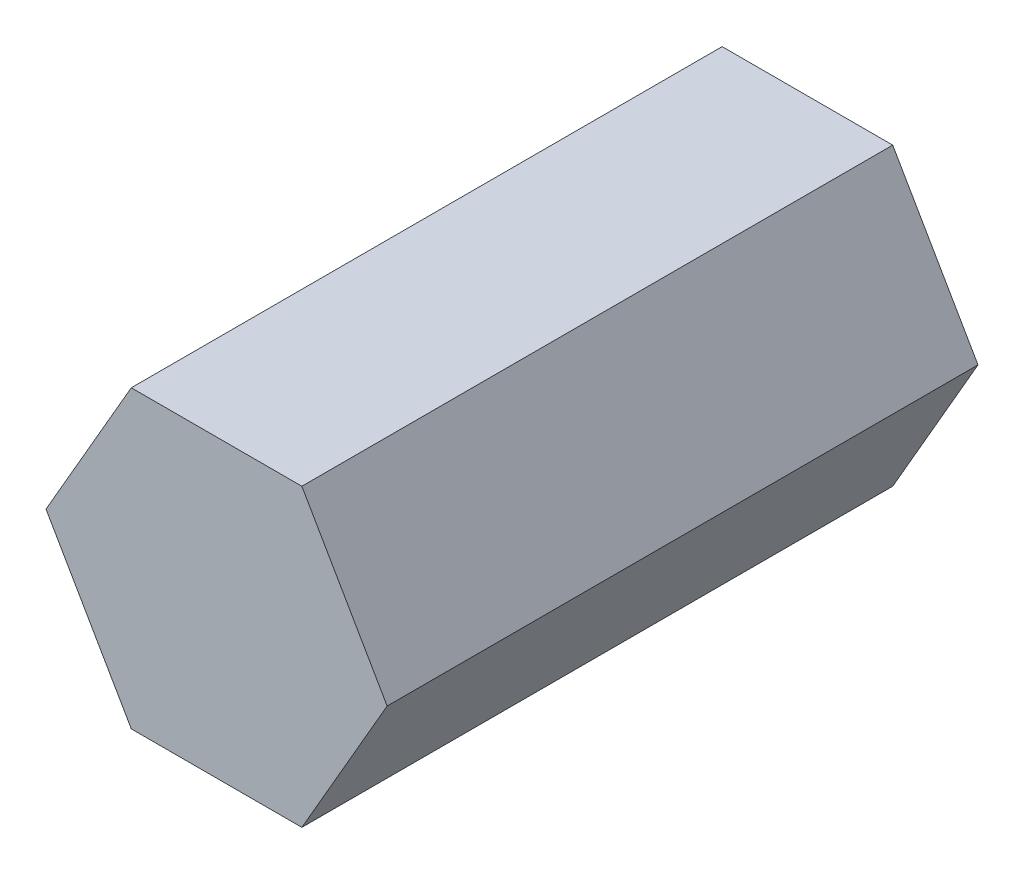
ISO-10303-21;
HEADER;
FILE_DESCRIPTION(('STEP AP214'),'2;1');
FILE_NAME('part.step','',(''),(''),'','','');
FILE_SCHEMA(('AUTOMOTIVE_DESIGN { 1 0 10303 214 1 1 1 1 }'));
ENDSEC;
DATA;
#1=APPLICATION_CONTEXT('core data for automotive mechanical design processes');
#2=APPLICATION_PROTOCOL_DEFINITION('international standard','automotive_design',2000,#1);
#3=PRODUCT_CONTEXT('',#1,'mechanical');
#4=PRODUCT('Part','Part','',(#3));
#5=PRODUCT_RELATED_PRODUCT_CATEGORY('part','',(#4));
#6=PRODUCT_DEFINITION_FORMATION('','',#4);
#7=PRODUCT_DEFINITION_CONTEXT('part definition',#1,'design');
#8=PRODUCT_DEFINITION('design','',#6,#7);
#9=PRODUCT_DEFINITION_SHAPE('','',#8);
#10=(LENGTH_UNIT() NAMED_UNIT(*) SI_UNIT(.MILLI.,.METRE.));
#11=(NAMED_UNIT(*) PLANE_ANGLE_UNIT() SI_UNIT($,.RADIAN.));
#12=(NAMED_UNIT(*) SI_UNIT($,.STERADIAN.) SOLID_ANGLE_UNIT());
#13=UNCERTAINTY_MEASURE_WITH_UNIT(LENGTH_MEASURE(1.E-05),#10,'distance_accuracy_value','');
#14=(GEOMETRIC_REPRESENTATION_CONTEXT(3) GLOBAL_UNCERTAINTY_ASSIGNED_CONTEXT((#13)) GLOBAL_UNIT_ASSIGNED_CONTEXT((#10,
#11,#12)) REPRESENTATION_CONTEXT('',''));
#15=CARTESIAN_POINT('',(0.,0.,0.));
#16=DIRECTION('',(0.,0.,1.));
#17=DIRECTION('',(1.,0.,0.));
#18=AXIS2_PLACEMENT_3D('',#15,#16,#17);
#19=CARTESIAN_POINT('',(3.66617420935412,-6.35,12.7));
#20=DIRECTION('',(-0.866025403784439,0.5,0.));
#21=DIRECTION('',(-0.5,-0.866025403784439,0.));
#22=AXIS2_PLACEMENT_3D('',#19,#20,#21);
#23=PLANE('',#22);
#24=DIRECTION('',(0.5,0.866025403784439,0.));
#25=VECTOR('',#24,1.);
#26=CARTESIAN_POINT('',(3.66617420935412,-6.35,-12.7));
#27=LINE('',#26,#25);
#28=CARTESIAN_POINT('',(3.66617420935412,-6.35,-12.7));
#29=VERTEX_POINT('',#28);
#30=CARTESIAN_POINT('',(7.33234841870825,0.,-12.7));
#31=VERTEX_POINT('',#30);
#32=EDGE_CURVE('E123',#29,#31,#27,.T.);
#33=ORIENTED_EDGE('',*,*,#32,.T.);
#34=DIRECTION('',(0.,0.,-1.));
#35=VECTOR('',#34,1.);
#36=CARTESIAN_POINT('',(7.33234841870825,0.,12.7));
#37=LINE('',#36,#35);
#38=CARTESIAN_POINT('',(7.33234841870825,0.,12.7));
#39=VERTEX_POINT('',#38);
#40=EDGE_CURVE('E11',#39,#31,#37,.T.);
#41=ORIENTED_EDGE('',*,*,#40,.F.);
#42=DIRECTION('',(0.5,0.866025403784439,0.));
#43=VECTOR('',#42,1.);
#44=CARTESIAN_POINT('',(3.66617420935412,-6.35,12.7));
#45=LINE('',#44,#43);
#46=CARTESIAN_POINT('',(3.66617420935412,-6.35,12.7));
#47=VERTEX_POINT('',#46);
#48=EDGE_CURVE('E133',#47,#39,#45,.T.);
#49=ORIENTED_EDGE('',*,*,#48,.F.);
#50=DIRECTION('',(0.,0.,-1.));
#51=VECTOR('',#50,1.);
#52=CARTESIAN_POINT('',(3.66617420935412,-6.35,12.7));
#53=LINE('',#52,#51);
#54=EDGE_CURVE('E119',#47,#29,#53,.T.);
#55=ORIENTED_EDGE('',*,*,#54,.T.);
#56=EDGE_LOOP('',(#33,#41,#49,#55));
#57=FACE_BOUND('',#56,.T.);
#58=ADVANCED_FACE('F39',(#57),#23,.F.);
#59=CARTESIAN_POINT('',(7.33234841870825,0.,12.7));
#60=DIRECTION('',(-0.866025403784439,-0.5,0.));
#61=DIRECTION('',(0.5,-0.866025403784439,0.));
#62=AXIS2_PLACEMENT_3D('',#59,#60,#61);
#63=PLANE('',#62);
#64=DIRECTION('',(-0.5,0.866025403784439,0.));
#65=VECTOR('',#64,1.);
#66=CARTESIAN_POINT('',(7.33234841870825,0.,-12.7));
#67=LINE('',#66,#65);
#68=CARTESIAN_POINT('',(3.66617420935412,6.35,-12.7));
#69=VERTEX_POINT('',#68);
#70=EDGE_CURVE('E126',#31,#69,#67,.T.);
#71=ORIENTED_EDGE('',*,*,#70,.T.);
#72=DIRECTION('',(0.,0.,-1.));
#73=VECTOR('',#72,1.);
#74=CARTESIAN_POINT('',(3.66617420935412,6.35,12.7));
#75=LINE('',#74,#73);
#76=CARTESIAN_POINT('',(3.66617420935412,6.35,12.7));
#77=VERTEX_POINT('',#76);
#78=EDGE_CURVE('E47',#77,#69,#75,.T.);
#79=ORIENTED_EDGE('',*,*,#78,.F.);
#80=DIRECTION('',(-0.5,0.866025403784439,0.));
#81=VECTOR('',#80,1.);
#82=CARTESIAN_POINT('',(7.33234841870825,0.,12.7));
#83=LINE('',#82,#81);
#84=EDGE_CURVE('E92',#39,#77,#83,.T.);
#85=ORIENTED_EDGE('',*,*,#84,.F.);
#86=ORIENTED_EDGE('',*,*,#40,.T.);
#87=EDGE_LOOP('',(#71,#79,#85,#86));
#88=FACE_BOUND('',#87,.T.);
#89=ADVANCED_FACE('F157',(#88),#63,.F.);
#90=CARTESIAN_POINT('',(3.66617420935412,6.35,12.7));
#91=DIRECTION('',(0.,-1.,0.));
#92=DIRECTION('',(1.,0.,0.));
#93=AXIS2_PLACEMENT_3D('',#90,#91,#92);
#94=PLANE('',#93);
#95=DIRECTION('',(-1.,0.,0.));
#96=VECTOR('',#95,1.);
#97=CARTESIAN_POINT('',(3.66617420935412,6.35,-12.7));
#98=LINE('',#97,#96);
#99=CARTESIAN_POINT('',(-3.66617420935412,6.35,-12.7));
#100=VERTEX_POINT('',#99);
#101=EDGE_CURVE('E128',#69,#100,#98,.T.);
#102=ORIENTED_EDGE('',*,*,#101,.T.);
#103=DIRECTION('',(0.,0.,-1.));
#104=VECTOR('',#103,1.);
#105=CARTESIAN_POINT('',(-3.66617420935412,6.35,12.7));
#106=LINE('',#105,#104);
#107=CARTESIAN_POINT('',(-3.66617420935412,6.35,12.7));
#108=VERTEX_POINT('',#107);
#109=EDGE_CURVE('E114',#108,#100,#106,.T.);
#110=ORIENTED_EDGE('',*,*,#109,.F.);
#111=DIRECTION('',(-1.,0.,0.));
#112=VECTOR('',#111,1.);
#113=CARTESIAN_POINT('',(3.66617420935412,6.35,12.7));
#114=LINE('',#113,#112);
#115=EDGE_CURVE('E105',#77,#108,#114,.T.);
#116=ORIENTED_EDGE('',*,*,#115,.F.);
#117=ORIENTED_EDGE('',*,*,#78,.T.);
#118=EDGE_LOOP('',(#102,#110,#116,#117));
#119=FACE_BOUND('',#118,.T.);
#120=ADVANCED_FACE('F139',(#119),#94,.F.);
#121=CARTESIAN_POINT('',(-3.66617420935412,6.35,12.7));
#122=DIRECTION('',(0.866025403784439,-0.5,0.));
#123=DIRECTION('',(0.5,0.866025403784439,0.));
#124=AXIS2_PLACEMENT_3D('',#121,#122,#123);
#125=PLANE('',#124);
#126=DIRECTION('',(-0.5,-0.866025403784439,0.));
#127=VECTOR('',#126,1.);
#128=CARTESIAN_POINT('',(-3.66617420935412,6.35,-12.7));
#129=LINE('',#128,#127);
#130=CARTESIAN_POINT('',(-7.33234841870825,0.,-12.7));
#131=VERTEX_POINT('',#130);
#132=EDGE_CURVE('E113',#100,#131,#129,.T.);
#133=ORIENTED_EDGE('',*,*,#132,.T.);
#134=DIRECTION('',(0.,0.,-1.));
#135=VECTOR('',#134,1.);
#136=CARTESIAN_POINT('',(-7.33234841870825,0.,12.7));
#137=LINE('',#136,#135);
#138=CARTESIAN_POINT('',(-7.33234841870825,0.,12.7));
#139=VERTEX_POINT('',#138);
#140=EDGE_CURVE('E110',#139,#131,#137,.T.);
#141=ORIENTED_EDGE('',*,*,#140,.F.);
#142=DIRECTION('',(-0.5,-0.866025403784439,0.));
#143=VECTOR('',#142,1.);
#144=CARTESIAN_POINT('',(-3.66617420935412,6.35,12.7));
#145=LINE('',#144,#143);
#146=EDGE_CURVE('E99',#108,#139,#145,.T.);
#147=ORIENTED_EDGE('',*,*,#146,.F.);
#148=ORIENTED_EDGE('',*,*,#109,.T.);
#149=EDGE_LOOP('',(#133,#141,#147,#148));
#150=FACE_BOUND('',#149,.T.);
#151=ADVANCED_FACE('F111',(#150),#125,.F.);
#152=CARTESIAN_POINT('',(-7.33234841870825,0.,12.7));
#153=DIRECTION('',(0.866025403784439,0.5,0.));
#154=DIRECTION('',(-0.5,0.866025403784439,0.));
#155=AXIS2_PLACEMENT_3D('',#152,#153,#154);
#156=PLANE('',#155);
#157=DIRECTION('',(0.5,-0.866025403784439,0.));
#158=VECTOR('',#157,1.);
#159=CARTESIAN_POINT('',(-7.33234841870825,0.,-12.7));
#160=LINE('',#159,#158);
#161=CARTESIAN_POINT('',(-3.66617420935413,-6.35,-12.7));
#162=VERTEX_POINT('',#161);
#163=EDGE_CURVE('E78',#131,#162,#160,.T.);
#164=ORIENTED_EDGE('',*,*,#163,.T.);
#165=DIRECTION('',(0.,0.,-1.));
#166=VECTOR('',#165,1.);
#167=CARTESIAN_POINT('',(-3.66617420935413,-6.35,12.7));
#168=LINE('',#167,#166);
#169=CARTESIAN_POINT('',(-3.66617420935413,-6.35,12.7));
#170=VERTEX_POINT('',#169);
#171=EDGE_CURVE('E115',#170,#162,#168,.T.);
#172=ORIENTED_EDGE('',*,*,#171,.F.);
#173=DIRECTION('',(0.5,-0.866025403784439,0.));
#174=VECTOR('',#173,1.);
#175=CARTESIAN_POINT('',(-7.33234841870825,0.,12.7));
#176=LINE('',#175,#174);
#177=EDGE_CURVE('E103',#139,#170,#176,.T.);
#178=ORIENTED_EDGE('',*,*,#177,.F.);
#179=ORIENTED_EDGE('',*,*,#140,.T.);
#180=EDGE_LOOP('',(#164,#172,#178,#179));
#181=FACE_BOUND('',#180,.T.);
#182=ADVANCED_FACE('F117',(#181),#156,.F.);
#183=CARTESIAN_POINT('',(-3.66617420935413,-6.35,12.7));
#184=DIRECTION('',(0.,1.,0.));
#185=DIRECTION('',(-1.,0.,0.));
#186=AXIS2_PLACEMENT_3D('',#183,#184,#185);
#187=PLANE('',#186);
#188=DIRECTION('',(1.,0.,0.));
#189=VECTOR('',#188,1.);
#190=CARTESIAN_POINT('',(-3.66617420935413,-6.35,-12.7));
#191=LINE('',#190,#189);
#192=EDGE_CURVE('E84',#162,#29,#191,.T.);
#193=ORIENTED_EDGE('',*,*,#192,.T.);
#194=ORIENTED_EDGE('',*,*,#54,.F.);
#195=DIRECTION('',(1.,0.,0.));
#196=VECTOR('',#195,1.);
#197=CARTESIAN_POINT('',(-3.66617420935413,-6.35,12.7));
#198=LINE('',#197,#196);
#199=EDGE_CURVE('E55',#170,#47,#198,.T.);
#200=ORIENTED_EDGE('',*,*,#199,.F.);
#201=ORIENTED_EDGE('',*,*,#171,.T.);
#202=EDGE_LOOP('',(#193,#194,#200,#201));
#203=FACE_BOUND('',#202,.T.);
#204=ADVANCED_FACE('F146',(#203),#187,.F.);
#205=CARTESIAN_POINT('',(0.,0.,12.7));
#206=DIRECTION('',(0.,0.,1.));
#207=DIRECTION('',(1.,0.,0.));
#208=AXIS2_PLACEMENT_3D('',#205,#206,#207);
#209=PLANE('',#208);
#210=ORIENTED_EDGE('',*,*,#48,.T.);
#211=ORIENTED_EDGE('',*,*,#84,.T.);
#212=ORIENTED_EDGE('',*,*,#115,.T.);
#213=ORIENTED_EDGE('',*,*,#146,.T.);
#214=ORIENTED_EDGE('',*,*,#177,.T.);
#215=ORIENTED_EDGE('',*,*,#199,.T.);
#216=EDGE_LOOP('',(#210,#211,#212,#213,#214,#215));
#217=FACE_BOUND('',#216,.T.);
#218=ADVANCED_FACE('F101',(#217),#209,.T.);
#219=CARTESIAN_POINT('',(0.,0.,-12.7));
#220=DIRECTION('',(0.,0.,1.));
#221=DIRECTION('',(1.,0.,0.));
#222=AXIS2_PLACEMENT_3D('',#219,#220,#221);
#223=PLANE('',#222);
#224=ORIENTED_EDGE('',*,*,#32,.F.);
#225=ORIENTED_EDGE('',*,*,#192,.F.);
#226=ORIENTED_EDGE('',*,*,#163,.F.);
#227=ORIENTED_EDGE('',*,*,#132,.F.);
#228=ORIENTED_EDGE('',*,*,#101,.F.);
#229=ORIENTED_EDGE('',*,*,#70,.F.);
#230=EDGE_LOOP('',(#224,#225,#226,#227,#228,#229));
#231=FACE_BOUND('',#230,.T.);
#232=ADVANCED_FACE('F142',(#231),#223,.F.);
#233=CLOSED_SHELL('',(#58,#89,#120,#151,#182,#204,#218,#232));
#234=MANIFOLD_SOLID_BREP('B2',#233);
#235=ADVANCED_BREP_SHAPE_REPRESENTATION('',(#18,#234),#14);
#236=SHAPE_DEFINITION_REPRESENTATION(#9,#235);
ENDSEC;
END-ISO-10303-21;
